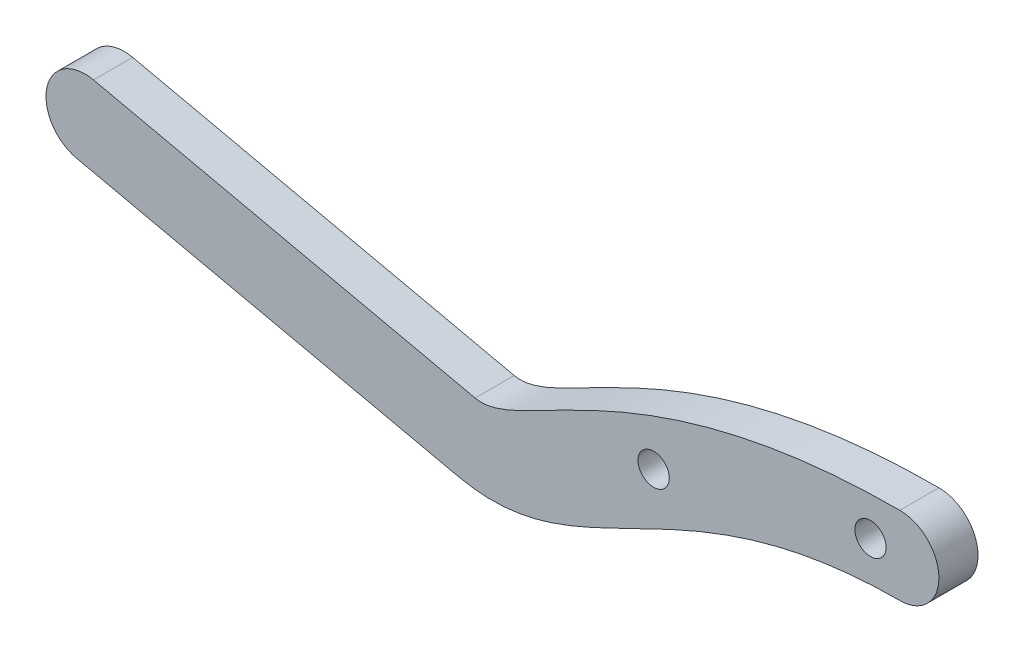
ISO-10303-21;
HEADER;
FILE_DESCRIPTION(('STEP AP214'),'2;1');
FILE_NAME('part.step','',(''),(''),'','','');
FILE_SCHEMA(('AUTOMOTIVE_DESIGN { 1 0 10303 214 1 1 1 1 }'));
ENDSEC;
DATA;
#1=APPLICATION_CONTEXT('core data for automotive mechanical design processes');
#2=APPLICATION_PROTOCOL_DEFINITION('international standard','automotive_design',2000,#1);
#3=PRODUCT_CONTEXT('',#1,'mechanical');
#4=PRODUCT('Part','Part','',(#3));
#5=PRODUCT_RELATED_PRODUCT_CATEGORY('part','',(#4));
#6=PRODUCT_DEFINITION_FORMATION('','',#4);
#7=PRODUCT_DEFINITION_CONTEXT('part definition',#1,'design');
#8=PRODUCT_DEFINITION('design','',#6,#7);
#9=PRODUCT_DEFINITION_SHAPE('','',#8);
#10=(LENGTH_UNIT() NAMED_UNIT(*) SI_UNIT(.MILLI.,.METRE.));
#11=(NAMED_UNIT(*) PLANE_ANGLE_UNIT() SI_UNIT($,.RADIAN.));
#12=(NAMED_UNIT(*) SI_UNIT($,.STERADIAN.) SOLID_ANGLE_UNIT());
#13=UNCERTAINTY_MEASURE_WITH_UNIT(LENGTH_MEASURE(1.E-05),#10,'distance_accuracy_value','');
#14=(GEOMETRIC_REPRESENTATION_CONTEXT(3) GLOBAL_UNCERTAINTY_ASSIGNED_CONTEXT((#13)) GLOBAL_UNIT_ASSIGNED_CONTEXT((#10,
#11,#12)) REPRESENTATION_CONTEXT('',''));
#15=CARTESIAN_POINT('',(0.,0.,0.));
#16=DIRECTION('',(0.,0.,1.));
#17=DIRECTION('',(1.,0.,0.));
#18=AXIS2_PLACEMENT_3D('',#15,#16,#17);
#19=CARTESIAN_POINT('',(-80.3741879130598,-3.01912827601563,4.));
#20=DIRECTION('',(0.,0.,-1.));
#21=DIRECTION('',(-1.,0.,0.));
#22=AXIS2_PLACEMENT_3D('',#19,#20,#21);
#23=PLANE('',#22);
#24=CARTESIAN_POINT('',(-80.3741879130598,-3.01912827601563,4.));
#25=DIRECTION('',(0.,0.,1.));
#26=DIRECTION('',(-1.,0.,0.));
#27=AXIS2_PLACEMENT_3D('',#24,#25,#26);
#28=CIRCLE('',#27,4.);
#29=CARTESIAN_POINT('',(-79.5071500332389,0.88577189107644,4.));
#30=VERTEX_POINT('',#29);
#31=CARTESIAN_POINT('',(-81.2412257928807,-6.9240284431077,4.));
#32=VERTEX_POINT('',#31);
#33=EDGE_CURVE('E155',#30,#32,#28,.T.);
#34=ORIENTED_EDGE('',*,*,#33,.T.);
#35=DIRECTION('',(0.976225041773018,-0.216759469955223,0.));
#36=VECTOR('',#35,1.);
#37=CARTESIAN_POINT('',(-81.2412257928807,-6.9240284431077,4.));
#38=LINE('',#37,#36);
#39=CARTESIAN_POINT('',(-42.19222412196,-15.5944072413166,4.));
#40=VERTEX_POINT('',#39);
#41=EDGE_CURVE('E91',#32,#40,#38,.T.);
#42=ORIENTED_EDGE('',*,*,#41,.T.);
#43=CARTESIAN_POINT('',(-42.19222412196,-15.5944072413166,4.));
#44=CARTESIAN_POINT('',(-29.0423099638596,-18.5141934595534,4.));
#45=CARTESIAN_POINT('',(-20.6711996270017,-3.99999999999999,4.));
#46=CARTESIAN_POINT('',(3.00000000000003,-4.,4.));
#47=B_SPLINE_CURVE_WITH_KNOTS('',3,(#43,#44,#45,#46),.UNSPECIFIED.,.F.,.F.,(4,4),(0.,1.),.UNSPECIFIED.);
#48=CARTESIAN_POINT('',(3.00000000000003,-4.,4.));
#49=VERTEX_POINT('',#48);
#50=EDGE_CURVE('E104',#40,#49,#47,.T.);
#51=ORIENTED_EDGE('',*,*,#50,.T.);
#52=CARTESIAN_POINT('',(3.,0.,4.));
#53=DIRECTION('',(0.,0.,1.));
#54=DIRECTION('',(1.,0.,0.));
#55=AXIS2_PLACEMENT_3D('',#52,#53,#54);
#56=CIRCLE('',#55,4.);
#57=CARTESIAN_POINT('',(3.,4.,4.));
#58=VERTEX_POINT('',#57);
#59=EDGE_CURVE('E98',#49,#58,#56,.T.);
#60=ORIENTED_EDGE('',*,*,#59,.T.);
#61=CARTESIAN_POINT('',(3.00000000000005,4.,4.));
#62=CARTESIAN_POINT('',(-24.5851288496653,4.00000000000002,4.));
#63=CARTESIAN_POINT('',(-35.5218228223751,-8.88066085143732,4.));
#64=CARTESIAN_POINT('',(-40.4581483623182,-7.78460690713247,4.));
#65=B_SPLINE_CURVE_WITH_KNOTS('',3,(#61,#62,#63,#64),.UNSPECIFIED.,.F.,.F.,(4,4),(0.,1.),.UNSPECIFIED.);
#66=CARTESIAN_POINT('',(-40.4581483623182,-7.78460690713247,4.));
#67=VERTEX_POINT('',#66);
#68=EDGE_CURVE('E102',#58,#67,#65,.T.);
#69=ORIENTED_EDGE('',*,*,#68,.T.);
#70=DIRECTION('',(-0.976225041773018,0.216759469955223,0.));
#71=VECTOR('',#70,1.);
#72=CARTESIAN_POINT('',(-79.5071500332389,0.88577189107644,4.));
#73=LINE('',#72,#71);
#74=EDGE_CURVE('E54',#67,#30,#73,.T.);
#75=ORIENTED_EDGE('',*,*,#74,.T.);
#76=EDGE_LOOP('',(#34,#42,#51,#60,#69,#75));
#77=FACE_BOUND('',#76,.T.);
#78=CARTESIAN_POINT('',(-22.19222412196,-4.95620946203584,4.));
#79=DIRECTION('',(0.,0.,1.));
#80=DIRECTION('',(1.,0.,0.));
#81=AXIS2_PLACEMENT_3D('',#78,#79,#80);
#82=CIRCLE('',#81,1.6);
#83=CARTESIAN_POINT('',(-20.59222412196,-4.95620946203584,4.));
#84=VERTEX_POINT('',#83);
#85=EDGE_CURVE('E162',#84,#84,#82,.T.);
#86=ORIENTED_EDGE('',*,*,#85,.F.);
#87=EDGE_LOOP('',(#86));
#88=FACE_BOUND('',#87,.T.);
#89=CARTESIAN_POINT('',(0.,0.,4.));
#90=DIRECTION('',(0.,0.,1.));
#91=DIRECTION('',(1.,0.,0.));
#92=AXIS2_PLACEMENT_3D('',#89,#90,#91);
#93=CIRCLE('',#92,1.6);
#94=CARTESIAN_POINT('',(1.6,0.,4.));
#95=VERTEX_POINT('',#94);
#96=EDGE_CURVE('E163',#95,#95,#93,.T.);
#97=ORIENTED_EDGE('',*,*,#96,.F.);
#98=EDGE_LOOP('',(#97));
#99=FACE_BOUND('',#98,.T.);
#100=ADVANCED_FACE('F36',(#77,#88,#99),#23,.F.);
#101=CARTESIAN_POINT('',(-80.3741879130598,-3.01912827601563,0.));
#102=DIRECTION('',(0.,0.,-1.));
#103=DIRECTION('',(-1.,0.,0.));
#104=AXIS2_PLACEMENT_3D('',#101,#102,#103);
#105=PLANE('',#104);
#106=CARTESIAN_POINT('',(-22.19222412196,-4.95620946203584,0.));
#107=DIRECTION('',(0.,0.,1.));
#108=DIRECTION('',(1.,0.,0.));
#109=AXIS2_PLACEMENT_3D('',#106,#107,#108);
#110=CIRCLE('',#109,1.6);
#111=CARTESIAN_POINT('',(-20.59222412196,-4.95620946203584,0.));
#112=VERTEX_POINT('',#111);
#113=EDGE_CURVE('E158',#112,#112,#110,.T.);
#114=ORIENTED_EDGE('',*,*,#113,.T.);
#115=EDGE_LOOP('',(#114));
#116=FACE_BOUND('',#115,.T.);
#117=CARTESIAN_POINT('',(-80.3741879130598,-3.01912827601563,0.));
#118=DIRECTION('',(0.,0.,1.));
#119=DIRECTION('',(-1.,0.,0.));
#120=AXIS2_PLACEMENT_3D('',#117,#118,#119);
#121=CIRCLE('',#120,4.);
#122=CARTESIAN_POINT('',(-79.5071500332389,0.88577189107644,0.));
#123=VERTEX_POINT('',#122);
#124=CARTESIAN_POINT('',(-81.2412257928807,-6.9240284431077,0.));
#125=VERTEX_POINT('',#124);
#126=EDGE_CURVE('E167',#123,#125,#121,.T.);
#127=ORIENTED_EDGE('',*,*,#126,.F.);
#128=DIRECTION('',(-0.976225041773018,0.216759469955223,0.));
#129=VECTOR('',#128,1.);
#130=CARTESIAN_POINT('',(-79.5071500332389,0.88577189107644,0.));
#131=LINE('',#130,#129);
#132=CARTESIAN_POINT('',(-40.4581483623182,-7.78460690713247,0.));
#133=VERTEX_POINT('',#132);
#134=EDGE_CURVE('E83',#133,#123,#131,.T.);
#135=ORIENTED_EDGE('',*,*,#134,.F.);
#136=CARTESIAN_POINT('',(3.00000000000005,4.,0.));
#137=CARTESIAN_POINT('',(-24.5851288496653,4.00000000000002,0.));
#138=CARTESIAN_POINT('',(-35.5218228223751,-8.88066085143732,0.));
#139=CARTESIAN_POINT('',(-40.4581483623182,-7.78460690713247,0.));
#140=B_SPLINE_CURVE_WITH_KNOTS('',3,(#136,#137,#138,#139),.UNSPECIFIED.,.F.,.F.,(4,4),(0.,1.),.UNSPECIFIED.);
#141=CARTESIAN_POINT('',(3.,4.,0.));
#142=VERTEX_POINT('',#141);
#143=EDGE_CURVE('E77',#142,#133,#140,.T.);
#144=ORIENTED_EDGE('',*,*,#143,.F.);
#145=CARTESIAN_POINT('',(3.,0.,0.));
#146=DIRECTION('',(0.,0.,1.));
#147=DIRECTION('',(1.,0.,0.));
#148=AXIS2_PLACEMENT_3D('',#145,#146,#147);
#149=CIRCLE('',#148,4.);
#150=CARTESIAN_POINT('',(3.00000000000003,-4.,0.));
#151=VERTEX_POINT('',#150);
#152=EDGE_CURVE('E113',#151,#142,#149,.T.);
#153=ORIENTED_EDGE('',*,*,#152,.F.);
#154=CARTESIAN_POINT('',(-42.19222412196,-15.5944072413166,0.));
#155=CARTESIAN_POINT('',(-29.0423099638596,-18.5141934595534,0.));
#156=CARTESIAN_POINT('',(-20.6711996270017,-3.99999999999999,0.));
#157=CARTESIAN_POINT('',(3.00000000000003,-4.,0.));
#158=B_SPLINE_CURVE_WITH_KNOTS('',3,(#154,#155,#156,#157),.UNSPECIFIED.,.F.,.F.,(4,4),(0.,1.),.UNSPECIFIED.);
#159=CARTESIAN_POINT('',(-42.19222412196,-15.5944072413166,0.));
#160=VERTEX_POINT('',#159);
#161=EDGE_CURVE('E284',#160,#151,#158,.T.);
#162=ORIENTED_EDGE('',*,*,#161,.F.);
#163=DIRECTION('',(0.976225041773018,-0.216759469955223,0.));
#164=VECTOR('',#163,1.);
#165=CARTESIAN_POINT('',(-81.2412257928807,-6.9240284431077,0.));
#166=LINE('',#165,#164);
#167=EDGE_CURVE('E281',#125,#160,#166,.T.);
#168=ORIENTED_EDGE('',*,*,#167,.F.);
#169=EDGE_LOOP('',(#127,#135,#144,#153,#162,#168));
#170=FACE_BOUND('',#169,.T.);
#171=CARTESIAN_POINT('',(0.,0.,0.));
#172=DIRECTION('',(0.,0.,1.));
#173=DIRECTION('',(1.,0.,0.));
#174=AXIS2_PLACEMENT_3D('',#171,#172,#173);
#175=CIRCLE('',#174,1.6);
#176=CARTESIAN_POINT('',(1.6,0.,0.));
#177=VERTEX_POINT('',#176);
#178=EDGE_CURVE('E168',#177,#177,#175,.T.);
#179=ORIENTED_EDGE('',*,*,#178,.T.);
#180=EDGE_LOOP('',(#179));
#181=FACE_BOUND('',#180,.T.);
#182=ADVANCED_FACE('F181',(#116,#170,#181),#105,.T.);
#183=CARTESIAN_POINT('',(-80.3741879130598,-3.01912827601563,4.));
#184=DIRECTION('',(0.,0.,-1.));
#185=DIRECTION('',(-1.,0.,0.));
#186=AXIS2_PLACEMENT_3D('',#183,#184,#185);
#187=CYLINDRICAL_SURFACE('',#186,4.);
#188=ORIENTED_EDGE('',*,*,#126,.T.);
#189=DIRECTION('',(0.,0.,-1.));
#190=VECTOR('',#189,1.);
#191=CARTESIAN_POINT('',(-81.2412257928807,-6.9240284431077,4.));
#192=LINE('',#191,#190);
#193=EDGE_CURVE('E11',#32,#125,#192,.T.);
#194=ORIENTED_EDGE('',*,*,#193,.F.);
#195=ORIENTED_EDGE('',*,*,#33,.F.);
#196=DIRECTION('',(0.,0.,-1.));
#197=VECTOR('',#196,1.);
#198=CARTESIAN_POINT('',(-79.5071500332389,0.88577189107644,4.));
#199=LINE('',#198,#197);
#200=EDGE_CURVE('E123',#30,#123,#199,.T.);
#201=ORIENTED_EDGE('',*,*,#200,.T.);
#202=EDGE_LOOP('',(#188,#194,#195,#201));
#203=FACE_BOUND('',#202,.T.);
#204=ADVANCED_FACE('F38',(#203),#187,.T.);
#205=CARTESIAN_POINT('',(-81.2412257928807,-6.9240284431077,4.));
#206=DIRECTION('',(0.216759469955223,0.976225041773018,0.));
#207=DIRECTION('',(-0.976225041773018,0.216759469955223,0.));
#208=AXIS2_PLACEMENT_3D('',#205,#206,#207);
#209=PLANE('',#208);
#210=ORIENTED_EDGE('',*,*,#167,.T.);
#211=DIRECTION('',(0.,0.,-1.));
#212=VECTOR('',#211,1.);
#213=CARTESIAN_POINT('',(-42.19222412196,-15.5944072413166,4.));
#214=LINE('',#213,#212);
#215=EDGE_CURVE('E46',#40,#160,#214,.T.);
#216=ORIENTED_EDGE('',*,*,#215,.F.);
#217=ORIENTED_EDGE('',*,*,#41,.F.);
#218=ORIENTED_EDGE('',*,*,#193,.T.);
#219=EDGE_LOOP('',(#210,#216,#217,#218));
#220=FACE_BOUND('',#219,.T.);
#221=ADVANCED_FACE('F143',(#220),#209,.F.);
#222=DIRECTION('',(0.,0.,-1.));
#223=VECTOR('',#222,1.);
#224=SURFACE_OF_LINEAR_EXTRUSION('',#47,#223);
#225=ORIENTED_EDGE('',*,*,#161,.T.);
#226=DIRECTION('',(0.,0.,-1.));
#227=VECTOR('',#226,1.);
#228=CARTESIAN_POINT('',(3.00000000000003,-4.,4.));
#229=LINE('',#228,#227);
#230=EDGE_CURVE('E115',#49,#151,#229,.T.);
#231=ORIENTED_EDGE('',*,*,#230,.F.);
#232=ORIENTED_EDGE('',*,*,#50,.F.);
#233=ORIENTED_EDGE('',*,*,#215,.T.);
#234=EDGE_LOOP('',(#225,#231,#232,#233));
#235=FACE_BOUND('',#234,.T.);
#236=ADVANCED_FACE('F141',(#235),#224,.F.);
#237=CARTESIAN_POINT('',(3.,0.,4.));
#238=DIRECTION('',(0.,0.,-1.));
#239=DIRECTION('',(-1.,0.,0.));
#240=AXIS2_PLACEMENT_3D('',#237,#238,#239);
#241=CYLINDRICAL_SURFACE('',#240,4.);
#242=ORIENTED_EDGE('',*,*,#152,.T.);
#243=DIRECTION('',(0.,0.,-1.));
#244=VECTOR('',#243,1.);
#245=CARTESIAN_POINT('',(3.,4.,4.));
#246=LINE('',#245,#244);
#247=EDGE_CURVE('E110',#58,#142,#246,.T.);
#248=ORIENTED_EDGE('',*,*,#247,.F.);
#249=ORIENTED_EDGE('',*,*,#59,.F.);
#250=ORIENTED_EDGE('',*,*,#230,.T.);
#251=EDGE_LOOP('',(#242,#248,#249,#250));
#252=FACE_BOUND('',#251,.T.);
#253=ADVANCED_FACE('F111',(#252),#241,.T.);
#254=DIRECTION('',(0.,0.,-1.));
#255=VECTOR('',#254,1.);
#256=SURFACE_OF_LINEAR_EXTRUSION('',#65,#255);
#257=ORIENTED_EDGE('',*,*,#143,.T.);
#258=DIRECTION('',(0.,0.,-1.));
#259=VECTOR('',#258,1.);
#260=CARTESIAN_POINT('',(-40.4581483623182,-7.78460690713247,4.));
#261=LINE('',#260,#259);
#262=EDGE_CURVE('E116',#67,#133,#261,.T.);
#263=ORIENTED_EDGE('',*,*,#262,.F.);
#264=ORIENTED_EDGE('',*,*,#68,.F.);
#265=ORIENTED_EDGE('',*,*,#247,.T.);
#266=EDGE_LOOP('',(#257,#263,#264,#265));
#267=FACE_BOUND('',#266,.T.);
#268=ADVANCED_FACE('F118',(#267),#256,.F.);
#269=CARTESIAN_POINT('',(-79.5071500332389,0.88577189107644,4.));
#270=DIRECTION('',(-0.216759469955223,-0.976225041773018,0.));
#271=DIRECTION('',(0.976225041773018,-0.216759469955223,0.));
#272=AXIS2_PLACEMENT_3D('',#269,#270,#271);
#273=PLANE('',#272);
#274=ORIENTED_EDGE('',*,*,#134,.T.);
#275=ORIENTED_EDGE('',*,*,#200,.F.);
#276=ORIENTED_EDGE('',*,*,#74,.F.);
#277=ORIENTED_EDGE('',*,*,#262,.T.);
#278=EDGE_LOOP('',(#274,#275,#276,#277));
#279=FACE_BOUND('',#278,.T.);
#280=ADVANCED_FACE('F137',(#279),#273,.F.);
#281=CARTESIAN_POINT('',(-22.19222412196,-4.95620946203584,4.));
#282=DIRECTION('',(0.,0.,-1.));
#283=DIRECTION('',(-1.,0.,0.));
#284=AXIS2_PLACEMENT_3D('',#281,#282,#283);
#285=CYLINDRICAL_SURFACE('',#284,1.6);
#286=ORIENTED_EDGE('',*,*,#85,.T.);
#287=EDGE_LOOP('',(#286));
#288=FACE_BOUND('',#287,.T.);
#289=ORIENTED_EDGE('',*,*,#113,.F.);
#290=EDGE_LOOP('',(#289));
#291=FACE_BOUND('',#290,.T.);
#292=ADVANCED_FACE('F188',(#288,#291),#285,.F.);
#293=CARTESIAN_POINT('',(0.,0.,4.));
#294=DIRECTION('',(0.,0.,-1.));
#295=DIRECTION('',(-1.,0.,0.));
#296=AXIS2_PLACEMENT_3D('',#293,#294,#295);
#297=CYLINDRICAL_SURFACE('',#296,1.6);
#298=ORIENTED_EDGE('',*,*,#96,.T.);
#299=EDGE_LOOP('',(#298));
#300=FACE_BOUND('',#299,.T.);
#301=ORIENTED_EDGE('',*,*,#178,.F.);
#302=EDGE_LOOP('',(#301));
#303=FACE_BOUND('',#302,.T.);
#304=ADVANCED_FACE('F177',(#300,#303),#297,.F.);
#305=CLOSED_SHELL('',(#100,#182,#204,#221,#236,#253,#268,#280,#292,#304));
#306=MANIFOLD_SOLID_BREP('B2',#305);
#307=ADVANCED_BREP_SHAPE_REPRESENTATION('',(#18,#306),#14);
#308=SHAPE_DEFINITION_REPRESENTATION(#9,#307);
ENDSEC;
END-ISO-10303-21;
